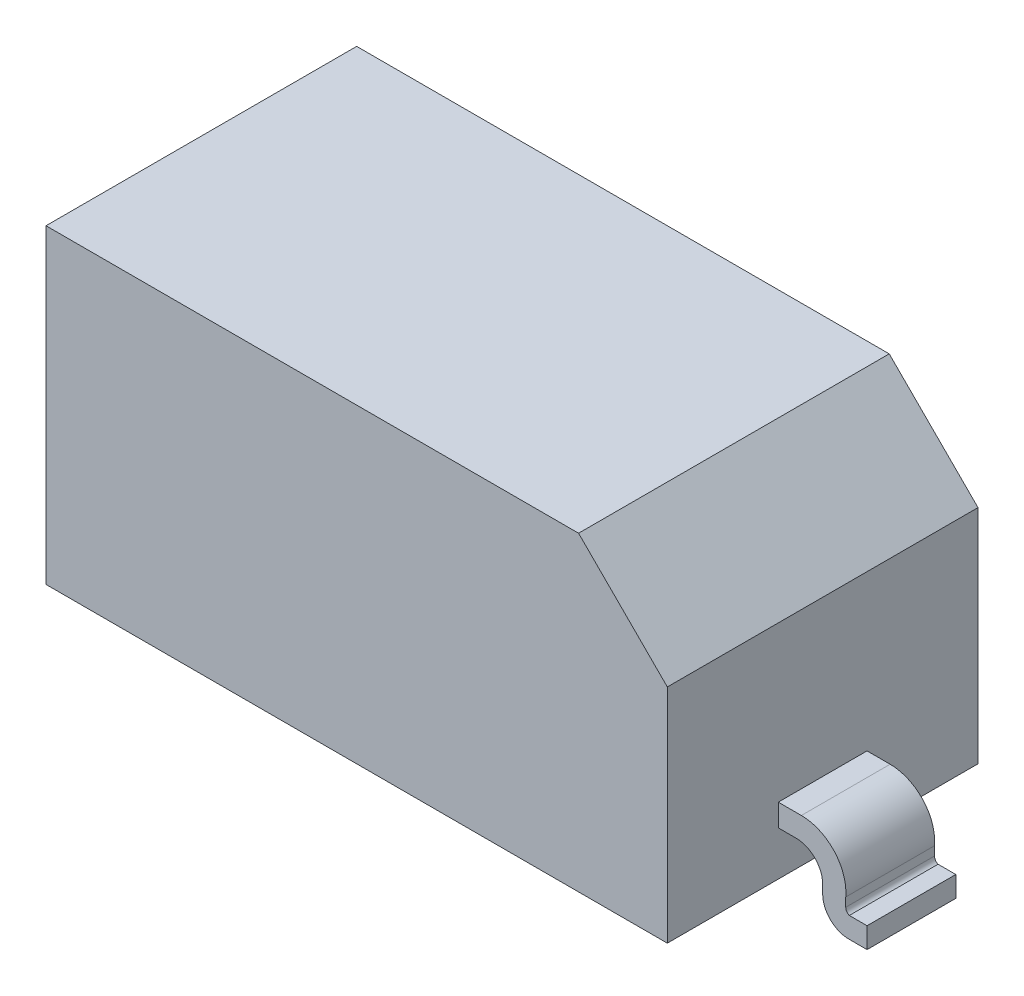
ISO-10303-21;
HEADER;
FILE_DESCRIPTION(('STEP AP214'),'2;1');
FILE_NAME('part.step','',(''),(''),'','','');
FILE_SCHEMA(('AUTOMOTIVE_DESIGN { 1 0 10303 214 1 1 1 1 }'));
ENDSEC;
DATA;
#1=APPLICATION_CONTEXT('core data for automotive mechanical design processes');
#2=APPLICATION_PROTOCOL_DEFINITION('international standard','automotive_design',2000,#1);
#3=PRODUCT_CONTEXT('',#1,'mechanical');
#4=PRODUCT('Part','Part','',(#3));
#5=PRODUCT_RELATED_PRODUCT_CATEGORY('part','',(#4));
#6=PRODUCT_DEFINITION_FORMATION('','',#4);
#7=PRODUCT_DEFINITION_CONTEXT('part definition',#1,'design');
#8=PRODUCT_DEFINITION('design','',#6,#7);
#9=PRODUCT_DEFINITION_SHAPE('','',#8);
#10=(LENGTH_UNIT() NAMED_UNIT(*) SI_UNIT(.MILLI.,.METRE.));
#11=(NAMED_UNIT(*) PLANE_ANGLE_UNIT() SI_UNIT($,.RADIAN.));
#12=(NAMED_UNIT(*) SI_UNIT($,.STERADIAN.) SOLID_ANGLE_UNIT());
#13=UNCERTAINTY_MEASURE_WITH_UNIT(LENGTH_MEASURE(1.E-05),#10,'distance_accuracy_value','');
#14=(GEOMETRIC_REPRESENTATION_CONTEXT(3) GLOBAL_UNCERTAINTY_ASSIGNED_CONTEXT((#13)) GLOBAL_UNIT_ASSIGNED_CONTEXT((#10,
#11,#12)) REPRESENTATION_CONTEXT('',''));
#15=CARTESIAN_POINT('',(0.,0.,0.));
#16=DIRECTION('',(0.,0.,1.));
#17=DIRECTION('',(1.,0.,0.));
#18=AXIS2_PLACEMENT_3D('',#15,#16,#17);
#19=CARTESIAN_POINT('',(-1.75,0.875,0.875));
#20=DIRECTION('',(1.,0.,0.));
#21=DIRECTION('',(0.,0.,-1.));
#22=AXIS2_PLACEMENT_3D('',#19,#20,#21);
#23=PLANE('',#22);
#24=DIRECTION('',(0.,-1.,0.));
#25=VECTOR('',#24,1.);
#26=CARTESIAN_POINT('',(-1.75,0.875,-0.875));
#27=LINE('',#26,#25);
#28=CARTESIAN_POINT('',(-1.75,0.875,-0.875));
#29=VERTEX_POINT('',#28);
#30=CARTESIAN_POINT('',(-1.75,-0.875,-0.875));
#31=VERTEX_POINT('',#30);
#32=EDGE_CURVE('E340',#29,#31,#27,.T.);
#33=ORIENTED_EDGE('',*,*,#32,.T.);
#34=DIRECTION('',(0.,0.,-1.));
#35=VECTOR('',#34,1.);
#36=CARTESIAN_POINT('',(-1.75,-0.875,0.875));
#37=LINE('',#36,#35);
#38=CARTESIAN_POINT('',(-1.75,-0.875,0.875));
#39=VERTEX_POINT('',#38);
#40=EDGE_CURVE('E11',#39,#31,#37,.T.);
#41=ORIENTED_EDGE('',*,*,#40,.F.);
#42=DIRECTION('',(0.,-1.,0.));
#43=VECTOR('',#42,1.);
#44=CARTESIAN_POINT('',(-1.75,0.875,0.875));
#45=LINE('',#44,#43);
#46=CARTESIAN_POINT('',(-1.75,0.875,0.875));
#47=VERTEX_POINT('',#46);
#48=EDGE_CURVE('E341',#47,#39,#45,.T.);
#49=ORIENTED_EDGE('',*,*,#48,.F.);
#50=DIRECTION('',(0.,0.,-1.));
#51=VECTOR('',#50,1.);
#52=CARTESIAN_POINT('',(-1.75,0.875,0.875));
#53=LINE('',#52,#51);
#54=EDGE_CURVE('E353',#47,#29,#53,.T.);
#55=ORIENTED_EDGE('',*,*,#54,.T.);
#56=EDGE_LOOP('',(#33,#41,#49,#55));
#57=FACE_BOUND('',#56,.T.);
#58=DIRECTION('',(0.,-1.,0.));
#59=VECTOR('',#58,1.);
#60=CARTESIAN_POINT('',(-1.75,-0.625,0.25));
#61=LINE('',#60,#59);
#62=CARTESIAN_POINT('',(-1.75,-0.49948491419278,0.25));
#63=VERTEX_POINT('',#62);
#64=CARTESIAN_POINT('',(-1.75,-0.625,0.25));
#65=VERTEX_POINT('',#64);
#66=EDGE_CURVE('E229',#63,#65,#61,.T.);
#67=ORIENTED_EDGE('',*,*,#66,.T.);
#68=DIRECTION('',(0.,0.,-1.));
#69=VECTOR('',#68,1.);
#70=CARTESIAN_POINT('',(-1.75,-0.625,0.25));
#71=LINE('',#70,#69);
#72=CARTESIAN_POINT('',(-1.75,-0.625,-0.25));
#73=VERTEX_POINT('',#72);
#74=EDGE_CURVE('E710',#65,#73,#71,.T.);
#75=ORIENTED_EDGE('',*,*,#74,.T.);
#76=DIRECTION('',(0.,-1.,0.));
#77=VECTOR('',#76,1.);
#78=CARTESIAN_POINT('',(-1.75,-0.625,-0.25));
#79=LINE('',#78,#77);
#80=CARTESIAN_POINT('',(-1.75,-0.499484914192779,-0.25));
#81=VERTEX_POINT('',#80);
#82=EDGE_CURVE('E250',#81,#73,#79,.T.);
#83=ORIENTED_EDGE('',*,*,#82,.F.);
#84=DIRECTION('',(0.,0.,-1.));
#85=VECTOR('',#84,1.);
#86=CARTESIAN_POINT('',(-1.75,-0.49948491419278,0.25));
#87=LINE('',#86,#85);
#88=EDGE_CURVE('E245',#63,#81,#87,.T.);
#89=ORIENTED_EDGE('',*,*,#88,.F.);
#90=EDGE_LOOP('',(#67,#75,#83,#89));
#91=FACE_BOUND('',#90,.T.);
#92=ADVANCED_FACE('F37',(#57,#91),#23,.F.);
#93=CARTESIAN_POINT('',(1.75,-0.874999999999999,0.875));
#94=DIRECTION('',(-1.,0.,0.));
#95=DIRECTION('',(0.,-1.,0.));
#96=AXIS2_PLACEMENT_3D('',#93,#94,#95);
#97=PLANE('',#96);
#98=DIRECTION('',(0.,1.,0.));
#99=VECTOR('',#98,1.);
#100=CARTESIAN_POINT('',(1.75,-0.874999999999999,-0.875));
#101=LINE('',#100,#99);
#102=CARTESIAN_POINT('',(1.75,-0.874999999999999,-0.875));
#103=VERTEX_POINT('',#102);
#104=CARTESIAN_POINT('',(1.75,0.375000000000001,-0.875));
#105=VERTEX_POINT('',#104);
#106=EDGE_CURVE('E358',#103,#105,#101,.T.);
#107=ORIENTED_EDGE('',*,*,#106,.T.);
#108=DIRECTION('',(0.,0.,-1.));
#109=VECTOR('',#108,1.);
#110=CARTESIAN_POINT('',(1.75,0.375000000000001,0.875));
#111=LINE('',#110,#109);
#112=CARTESIAN_POINT('',(1.75,0.375000000000001,0.875));
#113=VERTEX_POINT('',#112);
#114=EDGE_CURVE('E368',#113,#105,#111,.T.);
#115=ORIENTED_EDGE('',*,*,#114,.F.);
#116=DIRECTION('',(0.,1.,0.));
#117=VECTOR('',#116,1.);
#118=CARTESIAN_POINT('',(1.75,-0.874999999999999,0.875));
#119=LINE('',#118,#117);
#120=CARTESIAN_POINT('',(1.75,-0.874999999999999,0.875));
#121=VERTEX_POINT('',#120);
#122=EDGE_CURVE('E347',#121,#113,#119,.T.);
#123=ORIENTED_EDGE('',*,*,#122,.F.);
#124=DIRECTION('',(0.,0.,-1.));
#125=VECTOR('',#124,1.);
#126=CARTESIAN_POINT('',(1.75,-0.874999999999999,0.875));
#127=LINE('',#126,#125);
#128=EDGE_CURVE('E44',#121,#103,#127,.T.);
#129=ORIENTED_EDGE('',*,*,#128,.T.);
#130=EDGE_LOOP('',(#107,#115,#123,#129));
#131=FACE_BOUND('',#130,.T.);
#132=DIRECTION('',(0.,-1.,0.));
#133=VECTOR('',#132,1.);
#134=CARTESIAN_POINT('',(1.75,-0.625,0.25));
#135=LINE('',#134,#133);
#136=CARTESIAN_POINT('',(1.75,-0.49948491419278,0.25));
#137=VERTEX_POINT('',#136);
#138=CARTESIAN_POINT('',(1.75,-0.625,0.25));
#139=VERTEX_POINT('',#138);
#140=EDGE_CURVE('E260',#137,#139,#135,.T.);
#141=ORIENTED_EDGE('',*,*,#140,.F.);
#142=DIRECTION('',(0.,0.,-1.));
#143=VECTOR('',#142,1.);
#144=CARTESIAN_POINT('',(1.75,-0.49948491419278,0.25));
#145=LINE('',#144,#143);
#146=CARTESIAN_POINT('',(1.75,-0.49948491419278,-0.25));
#147=VERTEX_POINT('',#146);
#148=EDGE_CURVE('E285',#137,#147,#145,.T.);
#149=ORIENTED_EDGE('',*,*,#148,.T.);
#150=DIRECTION('',(0.,-1.,0.));
#151=VECTOR('',#150,1.);
#152=CARTESIAN_POINT('',(1.75,-0.625,-0.25));
#153=LINE('',#152,#151);
#154=CARTESIAN_POINT('',(1.75,-0.625,-0.25));
#155=VERTEX_POINT('',#154);
#156=EDGE_CURVE('E251',#147,#155,#153,.T.);
#157=ORIENTED_EDGE('',*,*,#156,.T.);
#158=DIRECTION('',(0.,0.,-1.));
#159=VECTOR('',#158,1.);
#160=CARTESIAN_POINT('',(1.75,-0.625,0.25));
#161=LINE('',#160,#159);
#162=EDGE_CURVE('E59',#139,#155,#161,.T.);
#163=ORIENTED_EDGE('',*,*,#162,.F.);
#164=EDGE_LOOP('',(#141,#149,#157,#163));
#165=FACE_BOUND('',#164,.T.);
#166=ADVANCED_FACE('F375',(#131,#165),#97,.F.);
#167=CARTESIAN_POINT('',(-1.75,-0.875,0.875));
#168=DIRECTION('',(0.,1.,0.));
#169=DIRECTION('',(-1.,0.,0.));
#170=AXIS2_PLACEMENT_3D('',#167,#168,#169);
#171=PLANE('',#170);
#172=DIRECTION('',(1.,0.,0.));
#173=VECTOR('',#172,1.);
#174=CARTESIAN_POINT('',(-1.75,-0.875,-0.875));
#175=LINE('',#174,#173);
#176=EDGE_CURVE('E356',#31,#103,#175,.T.);
#177=ORIENTED_EDGE('',*,*,#176,.T.);
#178=ORIENTED_EDGE('',*,*,#128,.F.);
#179=DIRECTION('',(1.,0.,0.));
#180=VECTOR('',#179,1.);
#181=CARTESIAN_POINT('',(-1.75,-0.875,0.875));
#182=LINE('',#181,#180);
#183=EDGE_CURVE('E344',#39,#121,#182,.T.);
#184=ORIENTED_EDGE('',*,*,#183,.F.);
#185=ORIENTED_EDGE('',*,*,#40,.T.);
#186=EDGE_LOOP('',(#177,#178,#184,#185));
#187=FACE_BOUND('',#186,.T.);
#188=ADVANCED_FACE('F396',(#187),#171,.F.);
#189=CARTESIAN_POINT('',(1.75,0.375000000000001,0.875));
#190=DIRECTION('',(-0.707106781186548,-0.707106781186547,0.));
#191=DIRECTION('',(0.707106781186547,-0.707106781186548,0.));
#192=AXIS2_PLACEMENT_3D('',#189,#190,#191);
#193=PLANE('',#192);
#194=DIRECTION('',(-0.707106781186547,0.707106781186548,0.));
#195=VECTOR('',#194,1.);
#196=CARTESIAN_POINT('',(1.75,0.375000000000001,-0.875));
#197=LINE('',#196,#195);
#198=CARTESIAN_POINT('',(1.25,0.875,-0.875));
#199=VERTEX_POINT('',#198);
#200=EDGE_CURVE('E360',#105,#199,#197,.T.);
#201=ORIENTED_EDGE('',*,*,#200,.T.);
#202=DIRECTION('',(0.,0.,-1.));
#203=VECTOR('',#202,1.);
#204=CARTESIAN_POINT('',(1.25,0.875,0.875));
#205=LINE('',#204,#203);
#206=CARTESIAN_POINT('',(1.25,0.875,0.875));
#207=VERTEX_POINT('',#206);
#208=EDGE_CURVE('E365',#207,#199,#205,.T.);
#209=ORIENTED_EDGE('',*,*,#208,.F.);
#210=DIRECTION('',(-0.707106781186547,0.707106781186548,0.));
#211=VECTOR('',#210,1.);
#212=CARTESIAN_POINT('',(1.75,0.375000000000001,0.875));
#213=LINE('',#212,#211);
#214=EDGE_CURVE('E349',#113,#207,#213,.T.);
#215=ORIENTED_EDGE('',*,*,#214,.F.);
#216=ORIENTED_EDGE('',*,*,#114,.T.);
#217=EDGE_LOOP('',(#201,#209,#215,#216));
#218=FACE_BOUND('',#217,.T.);
#219=ADVANCED_FACE('F386',(#218),#193,.F.);
#220=CARTESIAN_POINT('',(1.25,0.875,0.875));
#221=DIRECTION('',(0.,-1.,0.));
#222=DIRECTION('',(0.,0.,-1.));
#223=AXIS2_PLACEMENT_3D('',#220,#221,#222);
#224=PLANE('',#223);
#225=DIRECTION('',(-1.,0.,0.));
#226=VECTOR('',#225,1.);
#227=CARTESIAN_POINT('',(1.25,0.875,-0.875));
#228=LINE('',#227,#226);
#229=EDGE_CURVE('E345',#199,#29,#228,.T.);
#230=ORIENTED_EDGE('',*,*,#229,.T.);
#231=ORIENTED_EDGE('',*,*,#54,.F.);
#232=DIRECTION('',(-1.,0.,0.));
#233=VECTOR('',#232,1.);
#234=CARTESIAN_POINT('',(1.25,0.875,0.875));
#235=LINE('',#234,#233);
#236=EDGE_CURVE('E351',#207,#47,#235,.T.);
#237=ORIENTED_EDGE('',*,*,#236,.F.);
#238=ORIENTED_EDGE('',*,*,#208,.T.);
#239=EDGE_LOOP('',(#230,#231,#237,#238));
#240=FACE_BOUND('',#239,.T.);
#241=ADVANCED_FACE('F390',(#240),#224,.F.);
#242=CARTESIAN_POINT('',(-1.75,0.875,0.875));
#243=DIRECTION('',(0.,0.,-1.));
#244=DIRECTION('',(-1.,0.,0.));
#245=AXIS2_PLACEMENT_3D('',#242,#243,#244);
#246=PLANE('',#245);
#247=ORIENTED_EDGE('',*,*,#48,.T.);
#248=ORIENTED_EDGE('',*,*,#183,.T.);
#249=ORIENTED_EDGE('',*,*,#122,.T.);
#250=ORIENTED_EDGE('',*,*,#214,.T.);
#251=ORIENTED_EDGE('',*,*,#236,.T.);
#252=EDGE_LOOP('',(#247,#248,#249,#250,#251));
#253=FACE_BOUND('',#252,.T.);
#254=ADVANCED_FACE('F394',(#253),#246,.F.);
#255=CARTESIAN_POINT('',(-1.75,0.875,-0.875));
#256=DIRECTION('',(0.,0.,-1.));
#257=DIRECTION('',(-1.,0.,0.));
#258=AXIS2_PLACEMENT_3D('',#255,#256,#257);
#259=PLANE('',#258);
#260=ORIENTED_EDGE('',*,*,#32,.F.);
#261=ORIENTED_EDGE('',*,*,#229,.F.);
#262=ORIENTED_EDGE('',*,*,#200,.F.);
#263=ORIENTED_EDGE('',*,*,#106,.F.);
#264=ORIENTED_EDGE('',*,*,#176,.F.);
#265=EDGE_LOOP('',(#260,#261,#262,#263,#264));
#266=FACE_BOUND('',#265,.T.);
#267=ADVANCED_FACE('F382',(#266),#259,.T.);
#268=CARTESIAN_POINT('',(1.75,-0.625,0.25));
#269=DIRECTION('',(0.,1.,0.));
#270=DIRECTION('',(0.,0.,1.));
#271=AXIS2_PLACEMENT_3D('',#268,#269,#270);
#272=PLANE('',#271);
#273=DIRECTION('',(1.,0.,0.));
#274=VECTOR('',#273,1.);
#275=CARTESIAN_POINT('',(1.75,-0.625,-0.25));
#276=LINE('',#275,#274);
#277=CARTESIAN_POINT('',(1.85,-0.625,-0.25));
#278=VERTEX_POINT('',#277);
#279=EDGE_CURVE('E254',#155,#278,#276,.T.);
#280=ORIENTED_EDGE('',*,*,#279,.T.);
#281=DIRECTION('',(0.,0.,-1.));
#282=VECTOR('',#281,1.);
#283=CARTESIAN_POINT('',(1.85,-0.625,0.25));
#284=LINE('',#283,#282);
#285=CARTESIAN_POINT('',(1.85,-0.625,0.25));
#286=VERTEX_POINT('',#285);
#287=EDGE_CURVE('E336',#286,#278,#284,.T.);
#288=ORIENTED_EDGE('',*,*,#287,.F.);
#289=DIRECTION('',(1.,0.,0.));
#290=VECTOR('',#289,1.);
#291=CARTESIAN_POINT('',(1.75,-0.625,0.25));
#292=LINE('',#291,#290);
#293=EDGE_CURVE('E263',#139,#286,#292,.T.);
#294=ORIENTED_EDGE('',*,*,#293,.F.);
#295=ORIENTED_EDGE('',*,*,#162,.T.);
#296=EDGE_LOOP('',(#280,#288,#294,#295));
#297=FACE_BOUND('',#296,.T.);
#298=ADVANCED_FACE('F413',(#297),#272,.F.);
#299=CARTESIAN_POINT('',(1.85,-0.77503124674547,0.25));
#300=DIRECTION('',(0.,0.,-1.));
#301=DIRECTION('',(-1.,0.,0.));
#302=AXIS2_PLACEMENT_3D('',#299,#300,#301);
#303=CYLINDRICAL_SURFACE('',#302,0.15003124674547);
#304=CARTESIAN_POINT('',(1.85,-0.77503124674547,-0.25));
#305=DIRECTION('',(0.,0.,-1.));
#306=DIRECTION('',(-1.,0.,0.));
#307=AXIS2_PLACEMENT_3D('',#304,#305,#306);
#308=CIRCLE('',#307,0.15003124674547);
#309=CARTESIAN_POINT('',(2.,-0.771969384566991,-0.25));
#310=VERTEX_POINT('',#309);
#311=EDGE_CURVE('E288',#278,#310,#308,.T.);
#312=ORIENTED_EDGE('',*,*,#311,.T.);
#313=DIRECTION('',(0.,0.,-1.));
#314=VECTOR('',#313,1.);
#315=CARTESIAN_POINT('',(2.,-0.771969384566991,0.25));
#316=LINE('',#315,#314);
#317=CARTESIAN_POINT('',(2.,-0.771969384566991,0.25));
#318=VERTEX_POINT('',#317);
#319=EDGE_CURVE('E333',#318,#310,#316,.T.);
#320=ORIENTED_EDGE('',*,*,#319,.F.);
#321=CARTESIAN_POINT('',(1.85,-0.77503124674547,0.25));
#322=DIRECTION('',(0.,0.,-1.));
#323=DIRECTION('',(-1.,0.,0.));
#324=AXIS2_PLACEMENT_3D('',#321,#322,#323);
#325=CIRCLE('',#324,0.15003124674547);
#326=EDGE_CURVE('E266',#286,#318,#325,.T.);
#327=ORIENTED_EDGE('',*,*,#326,.F.);
#328=ORIENTED_EDGE('',*,*,#287,.T.);
#329=EDGE_LOOP('',(#312,#320,#327,#328));
#330=FACE_BOUND('',#329,.T.);
#331=ADVANCED_FACE('F418',(#330),#303,.F.);
#332=CARTESIAN_POINT('',(2.,-0.771969384566991,0.25));
#333=DIRECTION('',(1.,0.,0.));
#334=DIRECTION('',(0.,0.,-1.));
#335=AXIS2_PLACEMENT_3D('',#332,#333,#334);
#336=PLANE('',#335);
#337=DIRECTION('',(0.,-1.,0.));
#338=VECTOR('',#337,1.);
#339=CARTESIAN_POINT('',(2.,-0.771969384566991,-0.25));
#340=LINE('',#339,#338);
#341=CARTESIAN_POINT('',(2.,-0.821969384566991,-0.25));
#342=VERTEX_POINT('',#341);
#343=EDGE_CURVE('E290',#310,#342,#340,.T.);
#344=ORIENTED_EDGE('',*,*,#343,.T.);
#345=DIRECTION('',(0.,0.,-1.));
#346=VECTOR('',#345,1.);
#347=CARTESIAN_POINT('',(2.,-0.821969384566991,0.25));
#348=LINE('',#347,#346);
#349=CARTESIAN_POINT('',(2.,-0.821969384566991,0.25));
#350=VERTEX_POINT('',#349);
#351=EDGE_CURVE('E330',#350,#342,#348,.T.);
#352=ORIENTED_EDGE('',*,*,#351,.F.);
#353=DIRECTION('',(0.,-1.,0.));
#354=VECTOR('',#353,1.);
#355=CARTESIAN_POINT('',(2.,-0.771969384566991,0.25));
#356=LINE('',#355,#354);
#357=EDGE_CURVE('E268',#318,#350,#356,.T.);
#358=ORIENTED_EDGE('',*,*,#357,.F.);
#359=ORIENTED_EDGE('',*,*,#319,.T.);
#360=EDGE_LOOP('',(#344,#352,#358,#359));
#361=FACE_BOUND('',#360,.T.);
#362=ADVANCED_FACE('F421',(#361),#336,.F.);
#363=CARTESIAN_POINT('',(2.147,-0.821969384566991,0.25));
#364=DIRECTION('',(0.,0.,-1.));
#365=DIRECTION('',(-1.,0.,0.));
#366=AXIS2_PLACEMENT_3D('',#363,#364,#365);
#367=CYLINDRICAL_SURFACE('',#366,0.147);
#368=CARTESIAN_POINT('',(2.147,-0.821969384566991,-0.25));
#369=DIRECTION('',(0.,0.,1.));
#370=DIRECTION('',(1.,0.,0.));
#371=AXIS2_PLACEMENT_3D('',#368,#369,#370);
#372=CIRCLE('',#371,0.147);
#373=CARTESIAN_POINT('',(2.15,-0.968938769133981,-0.25));
#374=VERTEX_POINT('',#373);
#375=EDGE_CURVE('E292',#342,#374,#372,.T.);
#376=ORIENTED_EDGE('',*,*,#375,.T.);
#377=DIRECTION('',(0.,0.,-1.));
#378=VECTOR('',#377,1.);
#379=CARTESIAN_POINT('',(2.15,-0.968938769133981,0.25));
#380=LINE('',#379,#378);
#381=CARTESIAN_POINT('',(2.15,-0.968938769133981,0.25));
#382=VERTEX_POINT('',#381);
#383=EDGE_CURVE('E327',#382,#374,#380,.T.);
#384=ORIENTED_EDGE('',*,*,#383,.F.);
#385=CARTESIAN_POINT('',(2.147,-0.821969384566991,0.25));
#386=DIRECTION('',(0.,0.,1.));
#387=DIRECTION('',(1.,0.,0.));
#388=AXIS2_PLACEMENT_3D('',#385,#386,#387);
#389=CIRCLE('',#388,0.147);
#390=EDGE_CURVE('E270',#350,#382,#389,.T.);
#391=ORIENTED_EDGE('',*,*,#390,.F.);
#392=ORIENTED_EDGE('',*,*,#351,.T.);
#393=EDGE_LOOP('',(#376,#384,#391,#392));
#394=FACE_BOUND('',#393,.T.);
#395=ADVANCED_FACE('F425',(#394),#367,.T.);
#396=CARTESIAN_POINT('',(2.25,-0.968938769133981,0.25));
#397=DIRECTION('',(0.,1.,0.));
#398=DIRECTION('',(0.,0.,1.));
#399=AXIS2_PLACEMENT_3D('',#396,#397,#398);
#400=PLANE('',#399);
#401=DIRECTION('',(1.,0.,0.));
#402=VECTOR('',#401,1.);
#403=CARTESIAN_POINT('',(2.25,-0.968938769133981,-0.25));
#404=LINE('',#403,#402);
#405=CARTESIAN_POINT('',(2.25,-0.968938769133981,-0.25));
#406=VERTEX_POINT('',#405);
#407=EDGE_CURVE('E294',#374,#406,#404,.T.);
#408=ORIENTED_EDGE('',*,*,#407,.T.);
#409=DIRECTION('',(0.,0.,-1.));
#410=VECTOR('',#409,1.);
#411=CARTESIAN_POINT('',(2.25,-0.968938769133981,0.25));
#412=LINE('',#411,#410);
#413=CARTESIAN_POINT('',(2.25,-0.968938769133981,0.25));
#414=VERTEX_POINT('',#413);
#415=EDGE_CURVE('E324',#414,#406,#412,.T.);
#416=ORIENTED_EDGE('',*,*,#415,.F.);
#417=DIRECTION('',(1.,0.,0.));
#418=VECTOR('',#417,1.);
#419=CARTESIAN_POINT('',(2.25,-0.968938769133981,0.25));
#420=LINE('',#419,#418);
#421=EDGE_CURVE('E272',#382,#414,#420,.T.);
#422=ORIENTED_EDGE('',*,*,#421,.F.);
#423=ORIENTED_EDGE('',*,*,#383,.T.);
#424=EDGE_LOOP('',(#408,#416,#422,#423));
#425=FACE_BOUND('',#424,.T.);
#426=ADVANCED_FACE('F429',(#425),#400,.F.);
#427=CARTESIAN_POINT('',(2.25,-0.852248548132497,0.25));
#428=DIRECTION('',(-1.,0.,0.));
#429=DIRECTION('',(0.,0.,1.));
#430=AXIS2_PLACEMENT_3D('',#427,#428,#429);
#431=PLANE('',#430);
#432=DIRECTION('',(0.,1.,0.));
#433=VECTOR('',#432,1.);
#434=CARTESIAN_POINT('',(2.25,-0.852248548132497,-0.25));
#435=LINE('',#434,#433);
#436=CARTESIAN_POINT('',(2.25,-0.852248548132497,-0.25));
#437=VERTEX_POINT('',#436);
#438=EDGE_CURVE('E296',#406,#437,#435,.T.);
#439=ORIENTED_EDGE('',*,*,#438,.T.);
#440=DIRECTION('',(0.,0.,-1.));
#441=VECTOR('',#440,1.);
#442=CARTESIAN_POINT('',(2.25,-0.852248548132497,0.25));
#443=LINE('',#442,#441);
#444=CARTESIAN_POINT('',(2.25,-0.852248548132497,0.25));
#445=VERTEX_POINT('',#444);
#446=EDGE_CURVE('E321',#445,#437,#443,.T.);
#447=ORIENTED_EDGE('',*,*,#446,.F.);
#448=DIRECTION('',(0.,1.,0.));
#449=VECTOR('',#448,1.);
#450=CARTESIAN_POINT('',(2.25,-0.852248548132497,0.25));
#451=LINE('',#450,#449);
#452=EDGE_CURVE('E274',#414,#445,#451,.T.);
#453=ORIENTED_EDGE('',*,*,#452,.F.);
#454=ORIENTED_EDGE('',*,*,#415,.T.);
#455=EDGE_LOOP('',(#439,#447,#453,#454));
#456=FACE_BOUND('',#455,.T.);
#457=ADVANCED_FACE('F433',(#456),#431,.F.);
#458=CARTESIAN_POINT('',(2.15,-0.852248548132497,0.25));
#459=DIRECTION('',(0.,-1.,0.));
#460=DIRECTION('',(0.,0.,-1.));
#461=AXIS2_PLACEMENT_3D('',#458,#459,#460);
#462=PLANE('',#461);
#463=DIRECTION('',(-1.,0.,0.));
#464=VECTOR('',#463,1.);
#465=CARTESIAN_POINT('',(2.15,-0.852248548132497,-0.25));
#466=LINE('',#465,#464);
#467=CARTESIAN_POINT('',(2.15,-0.852248548132497,-0.25));
#468=VERTEX_POINT('',#467);
#469=EDGE_CURVE('E298',#437,#468,#466,.T.);
#470=ORIENTED_EDGE('',*,*,#469,.T.);
#471=DIRECTION('',(0.,0.,-1.));
#472=VECTOR('',#471,1.);
#473=CARTESIAN_POINT('',(2.15,-0.852248548132497,0.25));
#474=LINE('',#473,#472);
#475=CARTESIAN_POINT('',(2.15,-0.852248548132497,0.25));
#476=VERTEX_POINT('',#475);
#477=EDGE_CURVE('E318',#476,#468,#474,.T.);
#478=ORIENTED_EDGE('',*,*,#477,.F.);
#479=DIRECTION('',(-1.,0.,0.));
#480=VECTOR('',#479,1.);
#481=CARTESIAN_POINT('',(2.15,-0.852248548132497,0.25));
#482=LINE('',#481,#480);
#483=EDGE_CURVE('E276',#445,#476,#482,.T.);
#484=ORIENTED_EDGE('',*,*,#483,.F.);
#485=ORIENTED_EDGE('',*,*,#446,.T.);
#486=EDGE_LOOP('',(#470,#478,#484,#485));
#487=FACE_BOUND('',#486,.T.);
#488=ADVANCED_FACE('F437',(#487),#462,.F.);
#489=CARTESIAN_POINT('',(2.1625,-0.822248548132497,0.25));
#490=DIRECTION('',(0.,0.,-1.));
#491=DIRECTION('',(-1.,0.,0.));
#492=AXIS2_PLACEMENT_3D('',#489,#490,#491);
#493=CYLINDRICAL_SURFACE('',#492,0.0324999999999995);
#494=CARTESIAN_POINT('',(2.1625,-0.822248548132497,-0.25));
#495=DIRECTION('',(0.,0.,-1.));
#496=DIRECTION('',(1.,0.,0.));
#497=AXIS2_PLACEMENT_3D('',#494,#495,#496);
#498=CIRCLE('',#497,0.0324999999999995);
#499=CARTESIAN_POINT('',(2.13,-0.822248548132497,-0.25));
#500=VERTEX_POINT('',#499);
#501=EDGE_CURVE('E300',#468,#500,#498,.T.);
#502=ORIENTED_EDGE('',*,*,#501,.T.);
#503=DIRECTION('',(0.,0.,-1.));
#504=VECTOR('',#503,1.);
#505=CARTESIAN_POINT('',(2.13,-0.822248548132497,0.25));
#506=LINE('',#505,#504);
#507=CARTESIAN_POINT('',(2.13,-0.822248548132497,0.25));
#508=VERTEX_POINT('',#507);
#509=EDGE_CURVE('E315',#508,#500,#506,.T.);
#510=ORIENTED_EDGE('',*,*,#509,.F.);
#511=CARTESIAN_POINT('',(2.1625,-0.822248548132497,0.25));
#512=DIRECTION('',(0.,0.,-1.));
#513=DIRECTION('',(1.,0.,0.));
#514=AXIS2_PLACEMENT_3D('',#511,#512,#513);
#515=CIRCLE('',#514,0.0324999999999995);
#516=EDGE_CURVE('E278',#476,#508,#515,.T.);
#517=ORIENTED_EDGE('',*,*,#516,.F.);
#518=ORIENTED_EDGE('',*,*,#477,.T.);
#519=EDGE_LOOP('',(#502,#510,#517,#518));
#520=FACE_BOUND('',#519,.T.);
#521=ADVANCED_FACE('F441',(#520),#493,.F.);
#522=CARTESIAN_POINT('',(2.13,-0.772248548132497,0.25));
#523=DIRECTION('',(-1.,0.,0.));
#524=DIRECTION('',(0.,0.,1.));
#525=AXIS2_PLACEMENT_3D('',#522,#523,#524);
#526=PLANE('',#525);
#527=DIRECTION('',(0.,1.,0.));
#528=VECTOR('',#527,1.);
#529=CARTESIAN_POINT('',(2.13,-0.772248548132497,-0.25));
#530=LINE('',#529,#528);
#531=CARTESIAN_POINT('',(2.13,-0.772248548132497,-0.25));
#532=VERTEX_POINT('',#531);
#533=EDGE_CURVE('E302',#500,#532,#530,.T.);
#534=ORIENTED_EDGE('',*,*,#533,.T.);
#535=DIRECTION('',(0.,0.,-1.));
#536=VECTOR('',#535,1.);
#537=CARTESIAN_POINT('',(2.13,-0.772248548132497,0.25));
#538=LINE('',#537,#536);
#539=CARTESIAN_POINT('',(2.13,-0.772248548132497,0.25));
#540=VERTEX_POINT('',#539);
#541=EDGE_CURVE('E312',#540,#532,#538,.T.);
#542=ORIENTED_EDGE('',*,*,#541,.F.);
#543=DIRECTION('',(0.,1.,0.));
#544=VECTOR('',#543,1.);
#545=CARTESIAN_POINT('',(2.13,-0.772248548132497,0.25));
#546=LINE('',#545,#544);
#547=EDGE_CURVE('E280',#508,#540,#546,.T.);
#548=ORIENTED_EDGE('',*,*,#547,.F.);
#549=ORIENTED_EDGE('',*,*,#509,.T.);
#550=EDGE_LOOP('',(#534,#542,#548,#549));
#551=FACE_BOUND('',#550,.T.);
#552=ADVANCED_FACE('F445',(#551),#526,.F.);
#553=CARTESIAN_POINT('',(1.88,-0.75043478977307,0.25));
#554=DIRECTION('',(0.,0.,-1.));
#555=DIRECTION('',(-1.,0.,0.));
#556=AXIS2_PLACEMENT_3D('',#553,#554,#555);
#557=CYLINDRICAL_SURFACE('',#556,0.250949875580291);
#558=CARTESIAN_POINT('',(1.88,-0.75043478977307,-0.25));
#559=DIRECTION('',(0.,0.,1.));
#560=DIRECTION('',(-1.,0.,0.));
#561=AXIS2_PLACEMENT_3D('',#558,#559,#560);
#562=CIRCLE('',#561,0.250949875580291);
#563=CARTESIAN_POINT('',(1.88,-0.49948491419278,-0.25));
#564=VERTEX_POINT('',#563);
#565=EDGE_CURVE('E304',#532,#564,#562,.T.);
#566=ORIENTED_EDGE('',*,*,#565,.T.);
#567=DIRECTION('',(0.,0.,-1.));
#568=VECTOR('',#567,1.);
#569=CARTESIAN_POINT('',(1.88,-0.49948491419278,0.25));
#570=LINE('',#569,#568);
#571=CARTESIAN_POINT('',(1.88,-0.49948491419278,0.25));
#572=VERTEX_POINT('',#571);
#573=EDGE_CURVE('E309',#572,#564,#570,.T.);
#574=ORIENTED_EDGE('',*,*,#573,.F.);
#575=CARTESIAN_POINT('',(1.88,-0.75043478977307,0.25));
#576=DIRECTION('',(0.,0.,1.));
#577=DIRECTION('',(-1.,0.,0.));
#578=AXIS2_PLACEMENT_3D('',#575,#576,#577);
#579=CIRCLE('',#578,0.250949875580291);
#580=EDGE_CURVE('E282',#540,#572,#579,.T.);
#581=ORIENTED_EDGE('',*,*,#580,.F.);
#582=ORIENTED_EDGE('',*,*,#541,.T.);
#583=EDGE_LOOP('',(#566,#574,#581,#582));
#584=FACE_BOUND('',#583,.T.);
#585=ADVANCED_FACE('F449',(#584),#557,.T.);
#586=CARTESIAN_POINT('',(1.75,-0.49948491419278,0.25));
#587=DIRECTION('',(0.,-1.,0.));
#588=DIRECTION('',(0.,0.,-1.));
#589=AXIS2_PLACEMENT_3D('',#586,#587,#588);
#590=PLANE('',#589);
#591=DIRECTION('',(-1.,0.,0.));
#592=VECTOR('',#591,1.);
#593=CARTESIAN_POINT('',(1.75,-0.49948491419278,-0.25));
#594=LINE('',#593,#592);
#595=EDGE_CURVE('E264',#564,#147,#594,.T.);
#596=ORIENTED_EDGE('',*,*,#595,.T.);
#597=ORIENTED_EDGE('',*,*,#148,.F.);
#598=DIRECTION('',(-1.,0.,0.));
#599=VECTOR('',#598,1.);
#600=CARTESIAN_POINT('',(1.75,-0.49948491419278,0.25));
#601=LINE('',#600,#599);
#602=EDGE_CURVE('E284',#572,#137,#601,.T.);
#603=ORIENTED_EDGE('',*,*,#602,.F.);
#604=ORIENTED_EDGE('',*,*,#573,.T.);
#605=EDGE_LOOP('',(#596,#597,#603,#604));
#606=FACE_BOUND('',#605,.T.);
#607=ADVANCED_FACE('F453',(#606),#590,.F.);
#608=CARTESIAN_POINT('',(1.88,-0.75043478977307,0.25));
#609=DIRECTION('',(0.,0.,-1.));
#610=DIRECTION('',(-1.,0.,0.));
#611=AXIS2_PLACEMENT_3D('',#608,#609,#610);
#612=PLANE('',#611);
#613=ORIENTED_EDGE('',*,*,#140,.T.);
#614=ORIENTED_EDGE('',*,*,#293,.T.);
#615=ORIENTED_EDGE('',*,*,#326,.T.);
#616=ORIENTED_EDGE('',*,*,#357,.T.);
#617=ORIENTED_EDGE('',*,*,#390,.T.);
#618=ORIENTED_EDGE('',*,*,#421,.T.);
#619=ORIENTED_EDGE('',*,*,#452,.T.);
#620=ORIENTED_EDGE('',*,*,#483,.T.);
#621=ORIENTED_EDGE('',*,*,#516,.T.);
#622=ORIENTED_EDGE('',*,*,#547,.T.);
#623=ORIENTED_EDGE('',*,*,#580,.T.);
#624=ORIENTED_EDGE('',*,*,#602,.T.);
#625=EDGE_LOOP('',(#613,#614,#615,#616,#617,#618,#619,#620,#621,#622,#623,#624));
#626=FACE_BOUND('',#625,.T.);
#627=ADVANCED_FACE('F457',(#626),#612,.F.);
#628=CARTESIAN_POINT('',(1.88,-0.75043478977307,-0.25));
#629=DIRECTION('',(0.,0.,-1.));
#630=DIRECTION('',(-1.,0.,0.));
#631=AXIS2_PLACEMENT_3D('',#628,#629,#630);
#632=PLANE('',#631);
#633=ORIENTED_EDGE('',*,*,#156,.F.);
#634=ORIENTED_EDGE('',*,*,#595,.F.);
#635=ORIENTED_EDGE('',*,*,#565,.F.);
#636=ORIENTED_EDGE('',*,*,#533,.F.);
#637=ORIENTED_EDGE('',*,*,#501,.F.);
#638=ORIENTED_EDGE('',*,*,#469,.F.);
#639=ORIENTED_EDGE('',*,*,#438,.F.);
#640=ORIENTED_EDGE('',*,*,#407,.F.);
#641=ORIENTED_EDGE('',*,*,#375,.F.);
#642=ORIENTED_EDGE('',*,*,#343,.F.);
#643=ORIENTED_EDGE('',*,*,#311,.F.);
#644=ORIENTED_EDGE('',*,*,#279,.F.);
#645=EDGE_LOOP('',(#633,#634,#635,#636,#637,#638,#639,#640,#641,#642,#643,#644));
#646=FACE_BOUND('',#645,.T.);
#647=ADVANCED_FACE('F459',(#646),#632,.T.);
#648=CARTESIAN_POINT('',(-1.75,-0.49948491419278,0.25));
#649=DIRECTION('',(0.,1.,0.));
#650=DIRECTION('',(0.,0.,1.));
#651=AXIS2_PLACEMENT_3D('',#648,#649,#650);
#652=PLANE('',#651);
#653=DIRECTION('',(1.,0.,0.));
#654=VECTOR('',#653,1.);
#655=CARTESIAN_POINT('',(-1.75,-0.49948491419278,-0.25));
#656=LINE('',#655,#654);
#657=CARTESIAN_POINT('',(-1.88,-0.49948491419278,-0.25));
#658=VERTEX_POINT('',#657);
#659=EDGE_CURVE('E51',#658,#81,#656,.T.);
#660=ORIENTED_EDGE('',*,*,#659,.F.);
#661=DIRECTION('',(0.,0.,-1.));
#662=VECTOR('',#661,1.);
#663=CARTESIAN_POINT('',(-1.88,-0.49948491419278,0.25));
#664=LINE('',#663,#662);
#665=CARTESIAN_POINT('',(-1.88,-0.49948491419278,0.25));
#666=VERTEX_POINT('',#665);
#667=EDGE_CURVE('E247',#666,#658,#664,.T.);
#668=ORIENTED_EDGE('',*,*,#667,.F.);
#669=DIRECTION('',(1.,0.,0.));
#670=VECTOR('',#669,1.);
#671=CARTESIAN_POINT('',(-1.75,-0.49948491419278,0.25));
#672=LINE('',#671,#670);
#673=EDGE_CURVE('E233',#666,#63,#672,.T.);
#674=ORIENTED_EDGE('',*,*,#673,.T.);
#675=ORIENTED_EDGE('',*,*,#88,.T.);
#676=EDGE_LOOP('',(#660,#668,#674,#675));
#677=FACE_BOUND('',#676,.T.);
#678=ADVANCED_FACE('F244',(#677),#652,.T.);
#679=CARTESIAN_POINT('',(-1.88,-0.75043478977307,0.25));
#680=DIRECTION('',(0.,0.,-1.));
#681=DIRECTION('',(-1.,0.,0.));
#682=AXIS2_PLACEMENT_3D('',#679,#680,#681);
#683=CYLINDRICAL_SURFACE('',#682,0.250949875580291);
#684=CARTESIAN_POINT('',(-1.88,-0.75043478977307,-0.25));
#685=DIRECTION('',(0.,0.,-1.));
#686=DIRECTION('',(1.,0.,0.));
#687=AXIS2_PLACEMENT_3D('',#684,#685,#686);
#688=CIRCLE('',#687,0.250949875580291);
#689=CARTESIAN_POINT('',(-2.13,-0.772248548132497,-0.25));
#690=VERTEX_POINT('',#689);
#691=EDGE_CURVE('E742',#690,#658,#688,.T.);
#692=ORIENTED_EDGE('',*,*,#691,.F.);
#693=DIRECTION('',(0.,0.,-1.));
#694=VECTOR('',#693,1.);
#695=CARTESIAN_POINT('',(-2.13,-0.772248548132497,0.25));
#696=LINE('',#695,#694);
#697=CARTESIAN_POINT('',(-2.13,-0.772248548132497,0.25));
#698=VERTEX_POINT('',#697);
#699=EDGE_CURVE('E256',#698,#690,#696,.T.);
#700=ORIENTED_EDGE('',*,*,#699,.F.);
#701=CARTESIAN_POINT('',(-1.88,-0.75043478977307,0.25));
#702=DIRECTION('',(0.,0.,-1.));
#703=DIRECTION('',(1.,0.,0.));
#704=AXIS2_PLACEMENT_3D('',#701,#702,#703);
#705=CIRCLE('',#704,0.250949875580291);
#706=EDGE_CURVE('E248',#698,#666,#705,.T.);
#707=ORIENTED_EDGE('',*,*,#706,.T.);
#708=ORIENTED_EDGE('',*,*,#667,.T.);
#709=EDGE_LOOP('',(#692,#700,#707,#708));
#710=FACE_BOUND('',#709,.T.);
#711=ADVANCED_FACE('F468',(#710),#683,.T.);
#712=CARTESIAN_POINT('',(-2.13,-0.772248548132497,0.25));
#713=DIRECTION('',(-1.,0.,0.));
#714=DIRECTION('',(0.,0.,1.));
#715=AXIS2_PLACEMENT_3D('',#712,#713,#714);
#716=PLANE('',#715);
#717=DIRECTION('',(0.,1.,0.));
#718=VECTOR('',#717,1.);
#719=CARTESIAN_POINT('',(-2.13,-0.772248548132497,-0.25));
#720=LINE('',#719,#718);
#721=CARTESIAN_POINT('',(-2.13,-0.822248548132497,-0.25));
#722=VERTEX_POINT('',#721);
#723=EDGE_CURVE('E738',#722,#690,#720,.T.);
#724=ORIENTED_EDGE('',*,*,#723,.F.);
#725=DIRECTION('',(0.,0.,-1.));
#726=VECTOR('',#725,1.);
#727=CARTESIAN_POINT('',(-2.13,-0.822248548132497,0.25));
#728=LINE('',#727,#726);
#729=CARTESIAN_POINT('',(-2.13,-0.822248548132497,0.25));
#730=VERTEX_POINT('',#729);
#731=EDGE_CURVE('E733',#730,#722,#728,.T.);
#732=ORIENTED_EDGE('',*,*,#731,.F.);
#733=DIRECTION('',(0.,1.,0.));
#734=VECTOR('',#733,1.);
#735=CARTESIAN_POINT('',(-2.13,-0.772248548132497,0.25));
#736=LINE('',#735,#734);
#737=EDGE_CURVE('E741',#730,#698,#736,.T.);
#738=ORIENTED_EDGE('',*,*,#737,.T.);
#739=ORIENTED_EDGE('',*,*,#699,.T.);
#740=EDGE_LOOP('',(#724,#732,#738,#739));
#741=FACE_BOUND('',#740,.T.);
#742=ADVANCED_FACE('F471',(#741),#716,.T.);
#743=CARTESIAN_POINT('',(-2.1625,-0.822248548132497,0.25));
#744=DIRECTION('',(0.,0.,-1.));
#745=DIRECTION('',(-1.,0.,0.));
#746=AXIS2_PLACEMENT_3D('',#743,#744,#745);
#747=CYLINDRICAL_SURFACE('',#746,0.0324999999999995);
#748=CARTESIAN_POINT('',(-2.1625,-0.822248548132497,-0.25));
#749=DIRECTION('',(0.,0.,1.));
#750=DIRECTION('',(-1.,0.,0.));
#751=AXIS2_PLACEMENT_3D('',#748,#749,#750);
#752=CIRCLE('',#751,0.0324999999999995);
#753=CARTESIAN_POINT('',(-2.15,-0.852248548132497,-0.25));
#754=VERTEX_POINT('',#753);
#755=EDGE_CURVE('E746',#754,#722,#752,.T.);
#756=ORIENTED_EDGE('',*,*,#755,.F.);
#757=DIRECTION('',(0.,0.,-1.));
#758=VECTOR('',#757,1.);
#759=CARTESIAN_POINT('',(-2.15,-0.852248548132497,0.25));
#760=LINE('',#759,#758);
#761=CARTESIAN_POINT('',(-2.15,-0.852248548132497,0.25));
#762=VERTEX_POINT('',#761);
#763=EDGE_CURVE('E731',#762,#754,#760,.T.);
#764=ORIENTED_EDGE('',*,*,#763,.F.);
#765=CARTESIAN_POINT('',(-2.1625,-0.822248548132497,0.25));
#766=DIRECTION('',(0.,0.,1.));
#767=DIRECTION('',(-1.,0.,0.));
#768=AXIS2_PLACEMENT_3D('',#765,#766,#767);
#769=CIRCLE('',#768,0.0324999999999995);
#770=EDGE_CURVE('E786',#762,#730,#769,.T.);
#771=ORIENTED_EDGE('',*,*,#770,.T.);
#772=ORIENTED_EDGE('',*,*,#731,.T.);
#773=EDGE_LOOP('',(#756,#764,#771,#772));
#774=FACE_BOUND('',#773,.T.);
#775=ADVANCED_FACE('F475',(#774),#747,.F.);
#776=CARTESIAN_POINT('',(-2.15,-0.852248548132497,0.25));
#777=DIRECTION('',(0.,1.,0.));
#778=DIRECTION('',(0.,0.,1.));
#779=AXIS2_PLACEMENT_3D('',#776,#777,#778);
#780=PLANE('',#779);
#781=DIRECTION('',(1.,0.,0.));
#782=VECTOR('',#781,1.);
#783=CARTESIAN_POINT('',(-2.15,-0.852248548132497,-0.25));
#784=LINE('',#783,#782);
#785=CARTESIAN_POINT('',(-2.25,-0.852248548132497,-0.25));
#786=VERTEX_POINT('',#785);
#787=EDGE_CURVE('E748',#786,#754,#784,.T.);
#788=ORIENTED_EDGE('',*,*,#787,.F.);
#789=DIRECTION('',(0.,0.,-1.));
#790=VECTOR('',#789,1.);
#791=CARTESIAN_POINT('',(-2.25,-0.852248548132497,0.25));
#792=LINE('',#791,#790);
#793=CARTESIAN_POINT('',(-2.25,-0.852248548132497,0.25));
#794=VERTEX_POINT('',#793);
#795=EDGE_CURVE('E729',#794,#786,#792,.T.);
#796=ORIENTED_EDGE('',*,*,#795,.F.);
#797=DIRECTION('',(1.,0.,0.));
#798=VECTOR('',#797,1.);
#799=CARTESIAN_POINT('',(-2.15,-0.852248548132497,0.25));
#800=LINE('',#799,#798);
#801=EDGE_CURVE('E783',#794,#762,#800,.T.);
#802=ORIENTED_EDGE('',*,*,#801,.T.);
#803=ORIENTED_EDGE('',*,*,#763,.T.);
#804=EDGE_LOOP('',(#788,#796,#802,#803));
#805=FACE_BOUND('',#804,.T.);
#806=ADVANCED_FACE('F479',(#805),#780,.T.);
#807=CARTESIAN_POINT('',(-2.25,-0.852248548132497,0.25));
#808=DIRECTION('',(-1.,0.,0.));
#809=DIRECTION('',(0.,0.,1.));
#810=AXIS2_PLACEMENT_3D('',#807,#808,#809);
#811=PLANE('',#810);
#812=DIRECTION('',(0.,1.,0.));
#813=VECTOR('',#812,1.);
#814=CARTESIAN_POINT('',(-2.25,-0.852248548132497,-0.25));
#815=LINE('',#814,#813);
#816=CARTESIAN_POINT('',(-2.25,-0.968938769133981,-0.25));
#817=VERTEX_POINT('',#816);
#818=EDGE_CURVE('E753',#817,#786,#815,.T.);
#819=ORIENTED_EDGE('',*,*,#818,.F.);
#820=DIRECTION('',(0.,0.,-1.));
#821=VECTOR('',#820,1.);
#822=CARTESIAN_POINT('',(-2.25,-0.968938769133981,0.25));
#823=LINE('',#822,#821);
#824=CARTESIAN_POINT('',(-2.25,-0.968938769133981,0.25));
#825=VERTEX_POINT('',#824);
#826=EDGE_CURVE('E727',#825,#817,#823,.T.);
#827=ORIENTED_EDGE('',*,*,#826,.F.);
#828=DIRECTION('',(0.,1.,0.));
#829=VECTOR('',#828,1.);
#830=CARTESIAN_POINT('',(-2.25,-0.852248548132497,0.25));
#831=LINE('',#830,#829);
#832=EDGE_CURVE('E780',#825,#794,#831,.T.);
#833=ORIENTED_EDGE('',*,*,#832,.T.);
#834=ORIENTED_EDGE('',*,*,#795,.T.);
#835=EDGE_LOOP('',(#819,#827,#833,#834));
#836=FACE_BOUND('',#835,.T.);
#837=ADVANCED_FACE('F483',(#836),#811,.T.);
#838=CARTESIAN_POINT('',(-2.25,-0.968938769133981,0.25));
#839=DIRECTION('',(0.,-1.,0.));
#840=DIRECTION('',(0.,0.,-1.));
#841=AXIS2_PLACEMENT_3D('',#838,#839,#840);
#842=PLANE('',#841);
#843=DIRECTION('',(-1.,0.,0.));
#844=VECTOR('',#843,1.);
#845=CARTESIAN_POINT('',(-2.25,-0.968938769133981,-0.25));
#846=LINE('',#845,#844);
#847=CARTESIAN_POINT('',(-2.15,-0.968938769133981,-0.25));
#848=VERTEX_POINT('',#847);
#849=EDGE_CURVE('E756',#848,#817,#846,.T.);
#850=ORIENTED_EDGE('',*,*,#849,.F.);
#851=DIRECTION('',(0.,0.,-1.));
#852=VECTOR('',#851,1.);
#853=CARTESIAN_POINT('',(-2.15,-0.968938769133981,0.25));
#854=LINE('',#853,#852);
#855=CARTESIAN_POINT('',(-2.15,-0.968938769133981,0.25));
#856=VERTEX_POINT('',#855);
#857=EDGE_CURVE('E725',#856,#848,#854,.T.);
#858=ORIENTED_EDGE('',*,*,#857,.F.);
#859=DIRECTION('',(-1.,0.,0.));
#860=VECTOR('',#859,1.);
#861=CARTESIAN_POINT('',(-2.25,-0.968938769133981,0.25));
#862=LINE('',#861,#860);
#863=EDGE_CURVE('E776',#856,#825,#862,.T.);
#864=ORIENTED_EDGE('',*,*,#863,.T.);
#865=ORIENTED_EDGE('',*,*,#826,.T.);
#866=EDGE_LOOP('',(#850,#858,#864,#865));
#867=FACE_BOUND('',#866,.T.);
#868=ADVANCED_FACE('F487',(#867),#842,.T.);
#869=CARTESIAN_POINT('',(-2.147,-0.821969384566991,0.25));
#870=DIRECTION('',(0.,0.,-1.));
#871=DIRECTION('',(-1.,0.,0.));
#872=AXIS2_PLACEMENT_3D('',#869,#870,#871);
#873=CYLINDRICAL_SURFACE('',#872,0.147);
#874=CARTESIAN_POINT('',(-2.147,-0.821969384566991,-0.25));
#875=DIRECTION('',(0.,0.,-1.));
#876=DIRECTION('',(-1.,0.,0.));
#877=AXIS2_PLACEMENT_3D('',#874,#875,#876);
#878=CIRCLE('',#877,0.147);
#879=CARTESIAN_POINT('',(-2.,-0.821969384566991,-0.25));
#880=VERTEX_POINT('',#879);
#881=EDGE_CURVE('E759',#880,#848,#878,.T.);
#882=ORIENTED_EDGE('',*,*,#881,.F.);
#883=DIRECTION('',(0.,0.,-1.));
#884=VECTOR('',#883,1.);
#885=CARTESIAN_POINT('',(-2.,-0.821969384566991,0.25));
#886=LINE('',#885,#884);
#887=CARTESIAN_POINT('',(-2.,-0.821969384566991,0.25));
#888=VERTEX_POINT('',#887);
#889=EDGE_CURVE('E723',#888,#880,#886,.T.);
#890=ORIENTED_EDGE('',*,*,#889,.F.);
#891=CARTESIAN_POINT('',(-2.147,-0.821969384566991,0.25));
#892=DIRECTION('',(0.,0.,-1.));
#893=DIRECTION('',(-1.,0.,0.));
#894=AXIS2_PLACEMENT_3D('',#891,#892,#893);
#895=CIRCLE('',#894,0.147);
#896=EDGE_CURVE('E794',#888,#856,#895,.T.);
#897=ORIENTED_EDGE('',*,*,#896,.T.);
#898=ORIENTED_EDGE('',*,*,#857,.T.);
#899=EDGE_LOOP('',(#882,#890,#897,#898));
#900=FACE_BOUND('',#899,.T.);
#901=ADVANCED_FACE('F491',(#900),#873,.T.);
#902=CARTESIAN_POINT('',(-2.,-0.771969384566991,0.25));
#903=DIRECTION('',(1.,0.,0.));
#904=DIRECTION('',(0.,0.,-1.));
#905=AXIS2_PLACEMENT_3D('',#902,#903,#904);
#906=PLANE('',#905);
#907=DIRECTION('',(0.,-1.,0.));
#908=VECTOR('',#907,1.);
#909=CARTESIAN_POINT('',(-2.,-0.771969384566991,-0.25));
#910=LINE('',#909,#908);
#911=CARTESIAN_POINT('',(-2.,-0.771969384566991,-0.25));
#912=VERTEX_POINT('',#911);
#913=EDGE_CURVE('E762',#912,#880,#910,.T.);
#914=ORIENTED_EDGE('',*,*,#913,.F.);
#915=DIRECTION('',(0.,0.,-1.));
#916=VECTOR('',#915,1.);
#917=CARTESIAN_POINT('',(-2.,-0.771969384566991,0.25));
#918=LINE('',#917,#916);
#919=CARTESIAN_POINT('',(-2.,-0.771969384566991,0.25));
#920=VERTEX_POINT('',#919);
#921=EDGE_CURVE('E716',#920,#912,#918,.T.);
#922=ORIENTED_EDGE('',*,*,#921,.F.);
#923=DIRECTION('',(0.,-1.,0.));
#924=VECTOR('',#923,1.);
#925=CARTESIAN_POINT('',(-2.,-0.771969384566991,0.25));
#926=LINE('',#925,#924);
#927=EDGE_CURVE('E769',#920,#888,#926,.T.);
#928=ORIENTED_EDGE('',*,*,#927,.T.);
#929=ORIENTED_EDGE('',*,*,#889,.T.);
#930=EDGE_LOOP('',(#914,#922,#928,#929));
#931=FACE_BOUND('',#930,.T.);
#932=ADVANCED_FACE('F495',(#931),#906,.T.);
#933=CARTESIAN_POINT('',(-1.85,-0.77503124674547,0.25));
#934=DIRECTION('',(0.,0.,-1.));
#935=DIRECTION('',(-1.,0.,0.));
#936=AXIS2_PLACEMENT_3D('',#933,#934,#935);
#937=CYLINDRICAL_SURFACE('',#936,0.15003124674547);
#938=CARTESIAN_POINT('',(-1.85,-0.77503124674547,-0.25));
#939=DIRECTION('',(0.,0.,1.));
#940=DIRECTION('',(1.,0.,0.));
#941=AXIS2_PLACEMENT_3D('',#938,#939,#940);
#942=CIRCLE('',#941,0.15003124674547);
#943=CARTESIAN_POINT('',(-1.85,-0.625,-0.25));
#944=VERTEX_POINT('',#943);
#945=EDGE_CURVE('E713',#944,#912,#942,.T.);
#946=ORIENTED_EDGE('',*,*,#945,.F.);
#947=DIRECTION('',(0.,0.,-1.));
#948=VECTOR('',#947,1.);
#949=CARTESIAN_POINT('',(-1.85,-0.625,0.25));
#950=LINE('',#949,#948);
#951=CARTESIAN_POINT('',(-1.85,-0.625,0.25));
#952=VERTEX_POINT('',#951);
#953=EDGE_CURVE('E711',#952,#944,#950,.T.);
#954=ORIENTED_EDGE('',*,*,#953,.F.);
#955=CARTESIAN_POINT('',(-1.85,-0.77503124674547,0.25));
#956=DIRECTION('',(0.,0.,1.));
#957=DIRECTION('',(1.,0.,0.));
#958=AXIS2_PLACEMENT_3D('',#955,#956,#957);
#959=CIRCLE('',#958,0.15003124674547);
#960=EDGE_CURVE('E718',#952,#920,#959,.T.);
#961=ORIENTED_EDGE('',*,*,#960,.T.);
#962=ORIENTED_EDGE('',*,*,#921,.T.);
#963=EDGE_LOOP('',(#946,#954,#961,#962));
#964=FACE_BOUND('',#963,.T.);
#965=ADVANCED_FACE('F499',(#964),#937,.F.);
#966=CARTESIAN_POINT('',(-1.75,-0.625,0.25));
#967=DIRECTION('',(0.,-1.,0.));
#968=DIRECTION('',(0.,0.,-1.));
#969=AXIS2_PLACEMENT_3D('',#966,#967,#968);
#970=PLANE('',#969);
#971=DIRECTION('',(-1.,0.,0.));
#972=VECTOR('',#971,1.);
#973=CARTESIAN_POINT('',(-1.75,-0.625,-0.25));
#974=LINE('',#973,#972);
#975=EDGE_CURVE('E241',#73,#944,#974,.T.);
#976=ORIENTED_EDGE('',*,*,#975,.F.);
#977=ORIENTED_EDGE('',*,*,#74,.F.);
#978=DIRECTION('',(-1.,0.,0.));
#979=VECTOR('',#978,1.);
#980=CARTESIAN_POINT('',(-1.75,-0.625,0.25));
#981=LINE('',#980,#979);
#982=EDGE_CURVE('E237',#65,#952,#981,.T.);
#983=ORIENTED_EDGE('',*,*,#982,.T.);
#984=ORIENTED_EDGE('',*,*,#953,.T.);
#985=EDGE_LOOP('',(#976,#977,#983,#984));
#986=FACE_BOUND('',#985,.T.);
#987=ADVANCED_FACE('F503',(#986),#970,.T.);
#988=CARTESIAN_POINT('',(-1.88,-0.75043478977307,0.25));
#989=DIRECTION('',(0.,0.,-1.));
#990=DIRECTION('',(1.,0.,0.));
#991=AXIS2_PLACEMENT_3D('',#988,#989,#990);
#992=PLANE('',#991);
#993=ORIENTED_EDGE('',*,*,#66,.F.);
#994=ORIENTED_EDGE('',*,*,#673,.F.);
#995=ORIENTED_EDGE('',*,*,#706,.F.);
#996=ORIENTED_EDGE('',*,*,#737,.F.);
#997=ORIENTED_EDGE('',*,*,#770,.F.);
#998=ORIENTED_EDGE('',*,*,#801,.F.);
#999=ORIENTED_EDGE('',*,*,#832,.F.);
#1000=ORIENTED_EDGE('',*,*,#863,.F.);
#1001=ORIENTED_EDGE('',*,*,#896,.F.);
#1002=ORIENTED_EDGE('',*,*,#927,.F.);
#1003=ORIENTED_EDGE('',*,*,#960,.F.);
#1004=ORIENTED_EDGE('',*,*,#982,.F.);
#1005=EDGE_LOOP('',(#993,#994,#995,#996,#997,#998,#999,#1000,#1001,#1002,#1003,#1004));
#1006=FACE_BOUND('',#1005,.T.);
#1007=ADVANCED_FACE('F231',(#1006),#992,.F.);
#1008=CARTESIAN_POINT('',(-1.88,-0.75043478977307,-0.25));
#1009=DIRECTION('',(0.,0.,-1.));
#1010=DIRECTION('',(1.,0.,0.));
#1011=AXIS2_PLACEMENT_3D('',#1008,#1009,#1010);
#1012=PLANE('',#1011);
#1013=ORIENTED_EDGE('',*,*,#82,.T.);
#1014=ORIENTED_EDGE('',*,*,#975,.T.);
#1015=ORIENTED_EDGE('',*,*,#945,.T.);
#1016=ORIENTED_EDGE('',*,*,#913,.T.);
#1017=ORIENTED_EDGE('',*,*,#881,.T.);
#1018=ORIENTED_EDGE('',*,*,#849,.T.);
#1019=ORIENTED_EDGE('',*,*,#818,.T.);
#1020=ORIENTED_EDGE('',*,*,#787,.T.);
#1021=ORIENTED_EDGE('',*,*,#755,.T.);
#1022=ORIENTED_EDGE('',*,*,#723,.T.);
#1023=ORIENTED_EDGE('',*,*,#691,.T.);
#1024=ORIENTED_EDGE('',*,*,#659,.T.);
#1025=EDGE_LOOP('',(#1013,#1014,#1015,#1016,#1017,#1018,#1019,#1020,#1021,#1022,#1023,#1024));
#1026=FACE_BOUND('',#1025,.T.);
#1027=ADVANCED_FACE('F508',(#1026),#1012,.T.);
#1028=CLOSED_SHELL('',(#92,#166,#188,#219,#241,#254,#267,#298,#331,#362,#395,#426,#457,#488,
#521,#552,#585,#607,#627,#647,#678,#711,#742,#775,#806,#837,#868,#901,#932,#965,#987,#1007,#1027));
#1029=MANIFOLD_SOLID_BREP('B2',#1028);
#1030=ADVANCED_BREP_SHAPE_REPRESENTATION('',(#18,#1029),#14);
#1031=SHAPE_DEFINITION_REPRESENTATION(#9,#1030);
ENDSEC;
END-ISO-10303-21;
